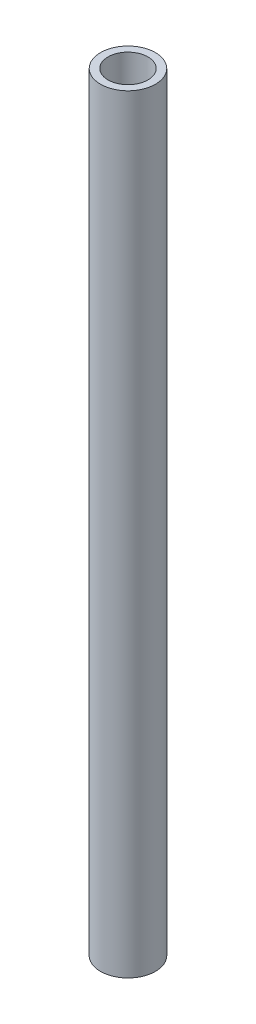
ISO-10303-21;
HEADER;
FILE_DESCRIPTION(('STEP AP214'),'2;1');
FILE_NAME('part.step','',(''),(''),'','','');
FILE_SCHEMA(('AUTOMOTIVE_DESIGN { 1 0 10303 214 1 1 1 1 }'));
ENDSEC;
DATA;
#1=APPLICATION_CONTEXT('core data for automotive mechanical design processes');
#2=APPLICATION_PROTOCOL_DEFINITION('international standard','automotive_design',2000,#1);
#3=PRODUCT_CONTEXT('',#1,'mechanical');
#4=PRODUCT('Part','Part','',(#3));
#5=PRODUCT_RELATED_PRODUCT_CATEGORY('part','',(#4));
#6=PRODUCT_DEFINITION_FORMATION('','',#4);
#7=PRODUCT_DEFINITION_CONTEXT('part definition',#1,'design');
#8=PRODUCT_DEFINITION('design','',#6,#7);
#9=PRODUCT_DEFINITION_SHAPE('','',#8);
#10=(LENGTH_UNIT() NAMED_UNIT(*) SI_UNIT(.MILLI.,.METRE.));
#11=(NAMED_UNIT(*) PLANE_ANGLE_UNIT() SI_UNIT($,.RADIAN.));
#12=(NAMED_UNIT(*) SI_UNIT($,.STERADIAN.) SOLID_ANGLE_UNIT());
#13=UNCERTAINTY_MEASURE_WITH_UNIT(LENGTH_MEASURE(1.E-05),#10,'distance_accuracy_value','');
#14=(GEOMETRIC_REPRESENTATION_CONTEXT(3) GLOBAL_UNCERTAINTY_ASSIGNED_CONTEXT((#13)) GLOBAL_UNIT_ASSIGNED_CONTEXT((#10,
#11,#12)) REPRESENTATION_CONTEXT('',''));
#15=CARTESIAN_POINT('',(0.,0.,0.));
#16=DIRECTION('',(0.,0.,1.));
#17=DIRECTION('',(1.,0.,0.));
#18=AXIS2_PLACEMENT_3D('',#15,#16,#17);
#19=CARTESIAN_POINT('',(0.,300.,0.));
#20=DIRECTION('',(0.,1.,0.));
#21=DIRECTION('',(0.,0.,1.));
#22=AXIS2_PLACEMENT_3D('',#19,#20,#21);
#23=PLANE('',#22);
#24=CARTESIAN_POINT('',(0.,300.,0.));
#25=DIRECTION('',(0.,1.,0.));
#26=DIRECTION('',(0.,0.,1.));
#27=AXIS2_PLACEMENT_3D('',#24,#25,#26);
#28=CIRCLE('',#27,10.715);
#29=CARTESIAN_POINT('',(0.,300.,10.715));
#30=VERTEX_POINT('',#29);
#31=EDGE_CURVE('E10',#30,#30,#28,.T.);
#32=ORIENTED_EDGE('',*,*,#31,.T.);
#33=EDGE_LOOP('',(#32));
#34=FACE_BOUND('',#33,.T.);
#35=CARTESIAN_POINT('',(0.,300.,0.));
#36=DIRECTION('',(0.,1.,0.));
#37=DIRECTION('',(0.,0.,1.));
#38=AXIS2_PLACEMENT_3D('',#35,#36,#37);
#39=CIRCLE('',#38,7.8);
#40=CARTESIAN_POINT('',(0.,300.,7.8));
#41=VERTEX_POINT('',#40);
#42=EDGE_CURVE('E42',#41,#41,#39,.T.);
#43=ORIENTED_EDGE('',*,*,#42,.F.);
#44=EDGE_LOOP('',(#43));
#45=FACE_BOUND('',#44,.T.);
#46=ADVANCED_FACE('F31',(#34,#45),#23,.T.);
#47=CARTESIAN_POINT('',(0.,0.,0.));
#48=DIRECTION('',(0.,1.,0.));
#49=DIRECTION('',(0.,0.,1.));
#50=AXIS2_PLACEMENT_3D('',#47,#48,#49);
#51=PLANE('',#50);
#52=CARTESIAN_POINT('',(0.,0.,0.));
#53=DIRECTION('',(0.,1.,0.));
#54=DIRECTION('',(0.,0.,1.));
#55=AXIS2_PLACEMENT_3D('',#52,#53,#54);
#56=CIRCLE('',#55,10.715);
#57=CARTESIAN_POINT('',(0.,0.,10.715));
#58=VERTEX_POINT('',#57);
#59=EDGE_CURVE('E35',#58,#58,#56,.T.);
#60=ORIENTED_EDGE('',*,*,#59,.F.);
#61=EDGE_LOOP('',(#60));
#62=FACE_BOUND('',#61,.T.);
#63=CARTESIAN_POINT('',(0.,0.,0.));
#64=DIRECTION('',(0.,1.,0.));
#65=DIRECTION('',(0.,0.,1.));
#66=AXIS2_PLACEMENT_3D('',#63,#64,#65);
#67=CIRCLE('',#66,7.8);
#68=CARTESIAN_POINT('',(0.,0.,7.8));
#69=VERTEX_POINT('',#68);
#70=EDGE_CURVE('E44',#69,#69,#67,.T.);
#71=ORIENTED_EDGE('',*,*,#70,.T.);
#72=EDGE_LOOP('',(#71));
#73=FACE_BOUND('',#72,.T.);
#74=ADVANCED_FACE('F54',(#62,#73),#51,.F.);
#75=CARTESIAN_POINT('',(0.,300.,0.));
#76=DIRECTION('',(0.,-1.,0.));
#77=DIRECTION('',(0.,0.,-1.));
#78=AXIS2_PLACEMENT_3D('',#75,#76,#77);
#79=CYLINDRICAL_SURFACE('',#78,10.715);
#80=ORIENTED_EDGE('',*,*,#31,.F.);
#81=EDGE_LOOP('',(#80));
#82=FACE_BOUND('',#81,.T.);
#83=ORIENTED_EDGE('',*,*,#59,.T.);
#84=EDGE_LOOP('',(#83));
#85=FACE_BOUND('',#84,.T.);
#86=ADVANCED_FACE('F33',(#82,#85),#79,.T.);
#87=CARTESIAN_POINT('',(0.,300.,0.));
#88=DIRECTION('',(0.,-1.,0.));
#89=DIRECTION('',(0.,0.,-1.));
#90=AXIS2_PLACEMENT_3D('',#87,#88,#89);
#91=CYLINDRICAL_SURFACE('',#90,7.8);
#92=ORIENTED_EDGE('',*,*,#42,.T.);
#93=EDGE_LOOP('',(#92));
#94=FACE_BOUND('',#93,.T.);
#95=ORIENTED_EDGE('',*,*,#70,.F.);
#96=EDGE_LOOP('',(#95));
#97=FACE_BOUND('',#96,.T.);
#98=ADVANCED_FACE('F50',(#94,#97),#91,.F.);
#99=CLOSED_SHELL('',(#46,#74,#86,#98));
#100=MANIFOLD_SOLID_BREP('B2',#99);
#101=ADVANCED_BREP_SHAPE_REPRESENTATION('',(#18,#100),#14);
#102=SHAPE_DEFINITION_REPRESENTATION(#9,#101);
ENDSEC;
END-ISO-10303-21;
